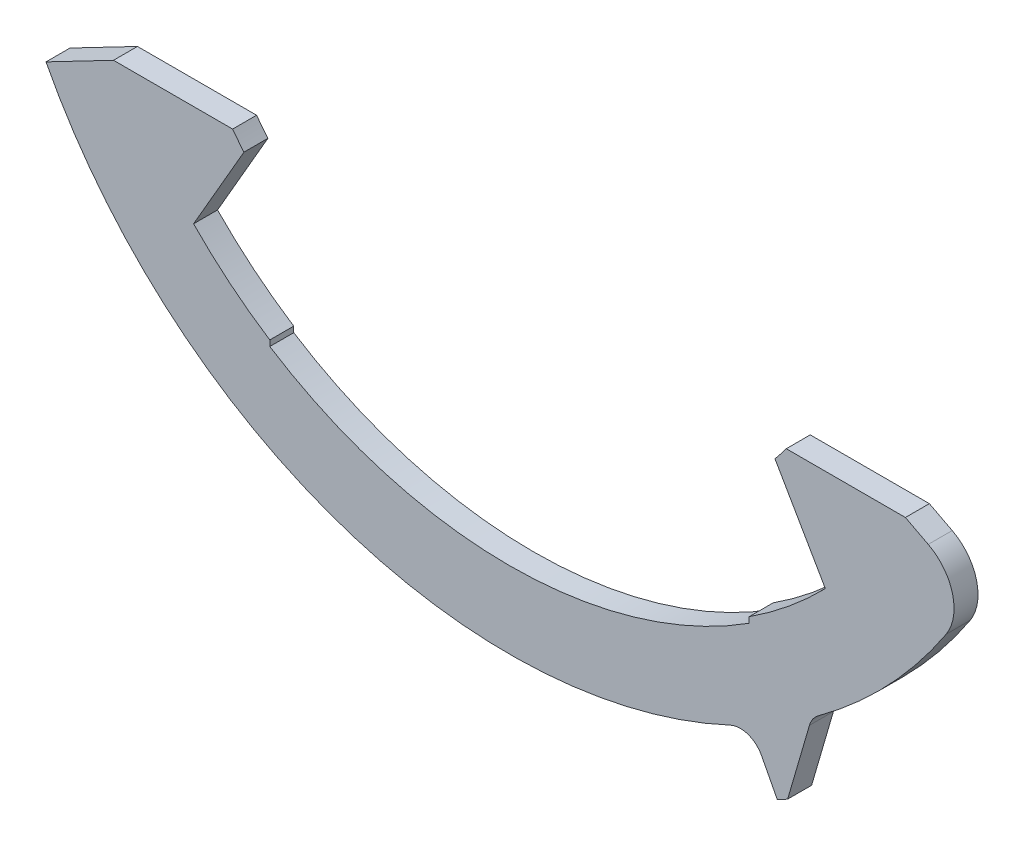
ISO-10303-21;
HEADER;
FILE_DESCRIPTION(('STEP AP214'),'2;1');
FILE_NAME('part.step','',(''),(''),'','','');
FILE_SCHEMA(('AUTOMOTIVE_DESIGN { 1 0 10303 214 1 1 1 1 }'));
ENDSEC;
DATA;
#1=APPLICATION_CONTEXT('core data for automotive mechanical design processes');
#2=APPLICATION_PROTOCOL_DEFINITION('international standard','automotive_design',2000,#1);
#3=PRODUCT_CONTEXT('',#1,'mechanical');
#4=PRODUCT('Part','Part','',(#3));
#5=PRODUCT_RELATED_PRODUCT_CATEGORY('part','',(#4));
#6=PRODUCT_DEFINITION_FORMATION('','',#4);
#7=PRODUCT_DEFINITION_CONTEXT('part definition',#1,'design');
#8=PRODUCT_DEFINITION('design','',#6,#7);
#9=PRODUCT_DEFINITION_SHAPE('','',#8);
#10=(LENGTH_UNIT() NAMED_UNIT(*) SI_UNIT(.MILLI.,.METRE.));
#11=(NAMED_UNIT(*) PLANE_ANGLE_UNIT() SI_UNIT($,.RADIAN.));
#12=(NAMED_UNIT(*) SI_UNIT($,.STERADIAN.) SOLID_ANGLE_UNIT());
#13=UNCERTAINTY_MEASURE_WITH_UNIT(LENGTH_MEASURE(1.E-05),#10,'distance_accuracy_value','');
#14=(GEOMETRIC_REPRESENTATION_CONTEXT(3) GLOBAL_UNCERTAINTY_ASSIGNED_CONTEXT((#13)) GLOBAL_UNIT_ASSIGNED_CONTEXT((#10,
#11,#12)) REPRESENTATION_CONTEXT('',''));
#15=CARTESIAN_POINT('',(0.,0.,0.));
#16=DIRECTION('',(0.,0.,1.));
#17=DIRECTION('',(1.,0.,0.));
#18=AXIS2_PLACEMENT_3D('',#15,#16,#17);
#19=CARTESIAN_POINT('',(4.81536330400592,-10.3330671269683,-0.00100000000000002));
#20=DIRECTION('',(0.,0.,1.));
#21=DIRECTION('',(1.,0.,0.));
#22=AXIS2_PLACEMENT_3D('',#19,#20,#21);
#23=CYLINDRICAL_SURFACE('',#22,0.5);
#24=DIRECTION('',(0.,0.,1.));
#25=VECTOR('',#24,1.);
#26=CARTESIAN_POINT('',(4.60416315909338,-9.87986242841707,-0.00100000000000002));
#27=LINE('',#26,#25);
#28=CARTESIAN_POINT('',(4.60416315909338,-9.87986242841707,0.));
#29=VERTEX_POINT('',#28);
#30=CARTESIAN_POINT('',(4.60416315909338,-9.87986242841707,0.5));
#31=VERTEX_POINT('',#30);
#32=EDGE_CURVE('E200',#29,#31,#27,.T.);
#33=ORIENTED_EDGE('',*,*,#32,.F.);
#34=CARTESIAN_POINT('',(4.81536330400592,-10.3330671269683,0.));
#35=DIRECTION('',(0.,0.,-1.));
#36=DIRECTION('',(-1.,0.,0.));
#37=AXIS2_PLACEMENT_3D('',#34,#35,#36);
#38=CIRCLE('',#37,0.5);
#39=CARTESIAN_POINT('',(5.25886872059503,-10.1021928203508,0.));
#40=VERTEX_POINT('',#39);
#41=EDGE_CURVE('E329',#40,#29,#38,.F.);
#42=ORIENTED_EDGE('',*,*,#41,.F.);
#43=DIRECTION('',(0.,0.,1.));
#44=VECTOR('',#43,1.);
#45=CARTESIAN_POINT('',(5.25886872059503,-10.1021928203508,-0.00100000000000002));
#46=LINE('',#45,#44);
#47=CARTESIAN_POINT('',(5.25886872059503,-10.1021928203508,0.5));
#48=VERTEX_POINT('',#47);
#49=EDGE_CURVE('E340',#40,#48,#46,.T.);
#50=ORIENTED_EDGE('',*,*,#49,.T.);
#51=CARTESIAN_POINT('',(4.81536330400592,-10.3330671269683,0.5));
#52=DIRECTION('',(0.,0.,1.));
#53=DIRECTION('',(0.195090322016125,0.980785280403231,0.));
#54=AXIS2_PLACEMENT_3D('',#51,#52,#53);
#55=CIRCLE('',#54,0.5);
#56=EDGE_CURVE('E337',#48,#31,#55,.T.);
#57=ORIENTED_EDGE('',*,*,#56,.T.);
#58=EDGE_LOOP('',(#33,#42,#50,#57));
#59=FACE_BOUND('',#58,.T.);
#60=ADVANCED_FACE('F53',(#59),#23,.F.);
#61=CARTESIAN_POINT('',(0.,0.,0.5));
#62=DIRECTION('',(0.,0.,-1.));
#63=DIRECTION('',(-1.,0.,0.));
#64=AXIS2_PLACEMENT_3D('',#61,#62,#63);
#65=CYLINDRICAL_SURFACE('',#64,12.1);
#66=CARTESIAN_POINT('',(0.,0.,0.));
#67=DIRECTION('',(0.,0.,1.));
#68=DIRECTION('',(1.,0.,0.));
#69=AXIS2_PLACEMENT_3D('',#66,#67,#68);
#70=CIRCLE('',#69,12.1);
#71=CARTESIAN_POINT('',(5.5871582201439,-10.7328310814565,0.));
#72=VERTEX_POINT('',#71);
#73=CARTESIAN_POINT('',(5.80331443124744,-10.6175110836804,0.));
#74=VERTEX_POINT('',#73);
#75=EDGE_CURVE('E254',#72,#74,#70,.T.);
#76=ORIENTED_EDGE('',*,*,#75,.T.);
#77=DIRECTION('',(0.,0.,1.));
#78=VECTOR('',#77,1.);
#79=CARTESIAN_POINT('',(5.80331443124744,-10.6175110836804,-0.00100000000000002));
#80=LINE('',#79,#78);
#81=CARTESIAN_POINT('',(5.80331443124744,-10.6175110836804,0.5));
#82=VERTEX_POINT('',#81);
#83=EDGE_CURVE('E326',#74,#82,#80,.T.);
#84=ORIENTED_EDGE('',*,*,#83,.T.);
#85=CARTESIAN_POINT('',(0.,0.,0.5));
#86=DIRECTION('',(0.,0.,1.));
#87=DIRECTION('',(1.,0.,0.));
#88=AXIS2_PLACEMENT_3D('',#85,#86,#87);
#89=CIRCLE('',#88,12.1);
#90=CARTESIAN_POINT('',(5.5871582201439,-10.7328310814565,0.5));
#91=VERTEX_POINT('',#90);
#92=EDGE_CURVE('E218',#91,#82,#89,.T.);
#93=ORIENTED_EDGE('',*,*,#92,.F.);
#94=DIRECTION('',(0.,0.,1.));
#95=VECTOR('',#94,1.);
#96=CARTESIAN_POINT('',(5.5871582201439,-10.7328310814565,-0.00100000000000002));
#97=LINE('',#96,#95);
#98=EDGE_CURVE('E339',#72,#91,#97,.T.);
#99=ORIENTED_EDGE('',*,*,#98,.F.);
#100=EDGE_LOOP('',(#76,#84,#93,#99));
#101=FACE_BOUND('',#100,.T.);
#102=ADVANCED_FACE('F385',(#101),#65,.T.);
#103=CARTESIAN_POINT('',(0.,0.,0.5));
#104=DIRECTION('',(0.,0.,-1.));
#105=DIRECTION('',(-1.,0.,0.));
#106=AXIS2_PLACEMENT_3D('',#103,#104,#105);
#107=CYLINDRICAL_SURFACE('',#106,7.2);
#108=CARTESIAN_POINT('',(0.,0.,0.));
#109=DIRECTION('',(0.,0.,-1.));
#110=DIRECTION('',(-1.,0.,0.));
#111=AXIS2_PLACEMENT_3D('',#108,#109,#110);
#112=CIRCLE('',#111,7.2);
#113=CARTESIAN_POINT('',(5.77494588719236,-4.3,0.));
#114=VERTEX_POINT('',#113);
#115=CARTESIAN_POINT('',(5.53923133011576,-4.5996647999027,0.));
#116=VERTEX_POINT('',#115);
#117=EDGE_CURVE('E231',#114,#116,#112,.T.);
#118=ORIENTED_EDGE('',*,*,#117,.T.);
#119=DIRECTION('',(0.,0.,-1.));
#120=VECTOR('',#119,1.);
#121=CARTESIAN_POINT('',(5.53923133011576,-4.5996647999027,0.5));
#122=LINE('',#121,#120);
#123=CARTESIAN_POINT('',(5.53923133011576,-4.5996647999027,0.5));
#124=VERTEX_POINT('',#123);
#125=EDGE_CURVE('E293',#124,#116,#122,.T.);
#126=ORIENTED_EDGE('',*,*,#125,.F.);
#127=CARTESIAN_POINT('',(0.,0.,0.5));
#128=DIRECTION('',(0.,0.,-1.));
#129=DIRECTION('',(-1.,0.,0.));
#130=AXIS2_PLACEMENT_3D('',#127,#128,#129);
#131=CIRCLE('',#130,7.2);
#132=CARTESIAN_POINT('',(5.77494588719236,-4.3,0.5));
#133=VERTEX_POINT('',#132);
#134=EDGE_CURVE('E261',#133,#124,#131,.T.);
#135=ORIENTED_EDGE('',*,*,#134,.F.);
#136=DIRECTION('',(0.,0.,-1.));
#137=VECTOR('',#136,1.);
#138=CARTESIAN_POINT('',(5.77494588719236,-4.3,0.5));
#139=LINE('',#138,#137);
#140=EDGE_CURVE('E230',#133,#114,#139,.T.);
#141=ORIENTED_EDGE('',*,*,#140,.T.);
#142=EDGE_LOOP('',(#118,#126,#135,#141));
#143=FACE_BOUND('',#142,.T.);
#144=ADVANCED_FACE('F396',(#143),#107,.F.);
#145=CARTESIAN_POINT('',(5.53923133011576,-4.5996647999027,0.5));
#146=DIRECTION('',(0.866025403784438,0.500000000000001,0.));
#147=DIRECTION('',(-0.500000000000001,0.866025403784438,0.));
#148=AXIS2_PLACEMENT_3D('',#145,#146,#147);
#149=PLANE('',#148);
#150=DIRECTION('',(0.500000000000001,-0.866025403784438,0.));
#151=VECTOR('',#150,1.);
#152=CARTESIAN_POINT('',(5.53923133011576,-4.5996647999027,0.));
#153=LINE('',#152,#151);
#154=CARTESIAN_POINT('',(6.59,-6.41964952314377,0.));
#155=VERTEX_POINT('',#154);
#156=EDGE_CURVE('E234',#116,#155,#153,.T.);
#157=ORIENTED_EDGE('',*,*,#156,.T.);
#158=DIRECTION('',(0.,0.,-1.));
#159=VECTOR('',#158,1.);
#160=CARTESIAN_POINT('',(6.59,-6.41964952314377,0.5));
#161=LINE('',#160,#159);
#162=CARTESIAN_POINT('',(6.59,-6.41964952314377,0.5));
#163=VERTEX_POINT('',#162);
#164=EDGE_CURVE('E290',#163,#155,#161,.T.);
#165=ORIENTED_EDGE('',*,*,#164,.F.);
#166=DIRECTION('',(0.500000000000001,-0.866025403784438,0.));
#167=VECTOR('',#166,1.);
#168=CARTESIAN_POINT('',(5.53923133011576,-4.5996647999027,0.5));
#169=LINE('',#168,#167);
#170=EDGE_CURVE('E347',#124,#163,#169,.T.);
#171=ORIENTED_EDGE('',*,*,#170,.F.);
#172=ORIENTED_EDGE('',*,*,#125,.T.);
#173=EDGE_LOOP('',(#157,#165,#171,#172));
#174=FACE_BOUND('',#173,.T.);
#175=ADVANCED_FACE('F443',(#174),#149,.F.);
#176=CARTESIAN_POINT('',(0.,0.,0.5));
#177=DIRECTION('',(0.,0.,-1.));
#178=DIRECTION('',(-1.,0.,0.));
#179=AXIS2_PLACEMENT_3D('',#176,#177,#178);
#180=CYLINDRICAL_SURFACE('',#179,9.2);
#181=CARTESIAN_POINT('',(0.,0.,0.));
#182=DIRECTION('',(0.,0.,-1.));
#183=DIRECTION('',(1.,0.,0.));
#184=AXIS2_PLACEMENT_3D('',#181,#182,#183);
#185=CIRCLE('',#184,9.2);
#186=CARTESIAN_POINT('',(5.,-7.72269383052313,0.));
#187=VERTEX_POINT('',#186);
#188=EDGE_CURVE('E237',#155,#187,#185,.T.);
#189=ORIENTED_EDGE('',*,*,#188,.T.);
#190=DIRECTION('',(0.,0.,-1.));
#191=VECTOR('',#190,1.);
#192=CARTESIAN_POINT('',(5.,-7.72269383052313,0.5));
#193=LINE('',#192,#191);
#194=CARTESIAN_POINT('',(5.,-7.72269383052313,0.5));
#195=VERTEX_POINT('',#194);
#196=EDGE_CURVE('E287',#195,#187,#193,.T.);
#197=ORIENTED_EDGE('',*,*,#196,.F.);
#198=CARTESIAN_POINT('',(0.,0.,0.5));
#199=DIRECTION('',(0.,0.,-1.));
#200=DIRECTION('',(1.,0.,0.));
#201=AXIS2_PLACEMENT_3D('',#198,#199,#200);
#202=CIRCLE('',#201,9.2);
#203=EDGE_CURVE('E349',#163,#195,#202,.T.);
#204=ORIENTED_EDGE('',*,*,#203,.F.);
#205=ORIENTED_EDGE('',*,*,#164,.T.);
#206=EDGE_LOOP('',(#189,#197,#204,#205));
#207=FACE_BOUND('',#206,.T.);
#208=ADVANCED_FACE('F439',(#207),#180,.F.);
#209=CARTESIAN_POINT('',(5.,-7.72269383052313,0.5));
#210=DIRECTION('',(1.,0.,0.));
#211=DIRECTION('',(0.,0.,-1.));
#212=AXIS2_PLACEMENT_3D('',#209,#210,#211);
#213=PLANE('',#212);
#214=DIRECTION('',(0.,-1.,0.));
#215=VECTOR('',#214,1.);
#216=CARTESIAN_POINT('',(5.,-7.72269383052313,0.));
#217=LINE('',#216,#215);
#218=CARTESIAN_POINT('',(4.99999999999999,-7.84155596804614,0.));
#219=VERTEX_POINT('',#218);
#220=EDGE_CURVE('E239',#187,#219,#217,.T.);
#221=ORIENTED_EDGE('',*,*,#220,.T.);
#222=DIRECTION('',(0.,0.,-1.));
#223=VECTOR('',#222,1.);
#224=CARTESIAN_POINT('',(4.99999999999999,-7.84155596804614,0.5));
#225=LINE('',#224,#223);
#226=CARTESIAN_POINT('',(4.99999999999999,-7.84155596804614,0.5));
#227=VERTEX_POINT('',#226);
#228=EDGE_CURVE('E284',#227,#219,#225,.T.);
#229=ORIENTED_EDGE('',*,*,#228,.F.);
#230=DIRECTION('',(0.,-1.,0.));
#231=VECTOR('',#230,1.);
#232=CARTESIAN_POINT('',(5.,-7.72269383052313,0.5));
#233=LINE('',#232,#231);
#234=EDGE_CURVE('E351',#195,#227,#233,.T.);
#235=ORIENTED_EDGE('',*,*,#234,.F.);
#236=ORIENTED_EDGE('',*,*,#196,.T.);
#237=EDGE_LOOP('',(#221,#229,#235,#236));
#238=FACE_BOUND('',#237,.T.);
#239=ADVANCED_FACE('F435',(#238),#213,.F.);
#240=CARTESIAN_POINT('',(0.,0.,0.5));
#241=DIRECTION('',(0.,0.,-1.));
#242=DIRECTION('',(-1.,0.,0.));
#243=AXIS2_PLACEMENT_3D('',#240,#241,#242);
#244=CYLINDRICAL_SURFACE('',#243,9.3);
#245=CARTESIAN_POINT('',(0.,0.,0.));
#246=DIRECTION('',(0.,0.,-1.));
#247=DIRECTION('',(1.,0.,0.));
#248=AXIS2_PLACEMENT_3D('',#245,#246,#247);
#249=CIRCLE('',#248,9.3);
#250=CARTESIAN_POINT('',(-5.,-7.84155596804614,0.));
#251=VERTEX_POINT('',#250);
#252=EDGE_CURVE('E241',#219,#251,#249,.T.);
#253=ORIENTED_EDGE('',*,*,#252,.T.);
#254=DIRECTION('',(0.,0.,-1.));
#255=VECTOR('',#254,1.);
#256=CARTESIAN_POINT('',(-5.,-7.84155596804614,0.5));
#257=LINE('',#256,#255);
#258=CARTESIAN_POINT('',(-5.,-7.84155596804614,0.5));
#259=VERTEX_POINT('',#258);
#260=EDGE_CURVE('E281',#259,#251,#257,.T.);
#261=ORIENTED_EDGE('',*,*,#260,.F.);
#262=CARTESIAN_POINT('',(0.,0.,0.5));
#263=DIRECTION('',(0.,0.,-1.));
#264=DIRECTION('',(1.,0.,0.));
#265=AXIS2_PLACEMENT_3D('',#262,#263,#264);
#266=CIRCLE('',#265,9.3);
#267=EDGE_CURVE('E353',#227,#259,#266,.T.);
#268=ORIENTED_EDGE('',*,*,#267,.F.);
#269=ORIENTED_EDGE('',*,*,#228,.T.);
#270=EDGE_LOOP('',(#253,#261,#268,#269));
#271=FACE_BOUND('',#270,.T.);
#272=ADVANCED_FACE('F431',(#271),#244,.F.);
#273=CARTESIAN_POINT('',(-5.,-7.72269383052313,0.5));
#274=DIRECTION('',(-1.,0.,0.));
#275=DIRECTION('',(0.,0.,1.));
#276=AXIS2_PLACEMENT_3D('',#273,#274,#275);
#277=PLANE('',#276);
#278=DIRECTION('',(0.,1.,0.));
#279=VECTOR('',#278,1.);
#280=CARTESIAN_POINT('',(-5.,-7.72269383052313,0.));
#281=LINE('',#280,#279);
#282=CARTESIAN_POINT('',(-5.00000000000001,-7.72269383052313,0.));
#283=VERTEX_POINT('',#282);
#284=EDGE_CURVE('E243',#251,#283,#281,.T.);
#285=ORIENTED_EDGE('',*,*,#284,.T.);
#286=DIRECTION('',(0.,0.,-1.));
#287=VECTOR('',#286,1.);
#288=CARTESIAN_POINT('',(-5.00000000000001,-7.72269383052313,0.5));
#289=LINE('',#288,#287);
#290=CARTESIAN_POINT('',(-5.00000000000001,-7.72269383052313,0.5));
#291=VERTEX_POINT('',#290);
#292=EDGE_CURVE('E278',#291,#283,#289,.T.);
#293=ORIENTED_EDGE('',*,*,#292,.F.);
#294=DIRECTION('',(0.,1.,0.));
#295=VECTOR('',#294,1.);
#296=CARTESIAN_POINT('',(-5.,-7.72269383052313,0.5));
#297=LINE('',#296,#295);
#298=EDGE_CURVE('E355',#259,#291,#297,.T.);
#299=ORIENTED_EDGE('',*,*,#298,.F.);
#300=ORIENTED_EDGE('',*,*,#260,.T.);
#301=EDGE_LOOP('',(#285,#293,#299,#300));
#302=FACE_BOUND('',#301,.T.);
#303=ADVANCED_FACE('F427',(#302),#277,.F.);
#304=CARTESIAN_POINT('',(0.,0.,0.5));
#305=DIRECTION('',(0.,0.,-1.));
#306=DIRECTION('',(-1.,0.,0.));
#307=AXIS2_PLACEMENT_3D('',#304,#305,#306);
#308=CYLINDRICAL_SURFACE('',#307,9.2);
#309=CARTESIAN_POINT('',(0.,0.,0.));
#310=DIRECTION('',(0.,0.,-1.));
#311=DIRECTION('',(1.,0.,0.));
#312=AXIS2_PLACEMENT_3D('',#309,#310,#311);
#313=CIRCLE('',#312,9.2);
#314=CARTESIAN_POINT('',(-6.59,-6.41964952314377,0.));
#315=VERTEX_POINT('',#314);
#316=EDGE_CURVE('E245',#283,#315,#313,.T.);
#317=ORIENTED_EDGE('',*,*,#316,.T.);
#318=DIRECTION('',(0.,0.,-1.));
#319=VECTOR('',#318,1.);
#320=CARTESIAN_POINT('',(-6.59,-6.41964952314377,0.5));
#321=LINE('',#320,#319);
#322=CARTESIAN_POINT('',(-6.59,-6.41964952314377,0.5));
#323=VERTEX_POINT('',#322);
#324=EDGE_CURVE('E275',#323,#315,#321,.T.);
#325=ORIENTED_EDGE('',*,*,#324,.F.);
#326=CARTESIAN_POINT('',(0.,0.,0.5));
#327=DIRECTION('',(0.,0.,-1.));
#328=DIRECTION('',(1.,0.,0.));
#329=AXIS2_PLACEMENT_3D('',#326,#327,#328);
#330=CIRCLE('',#329,9.2);
#331=EDGE_CURVE('E357',#291,#323,#330,.T.);
#332=ORIENTED_EDGE('',*,*,#331,.F.);
#333=ORIENTED_EDGE('',*,*,#292,.T.);
#334=EDGE_LOOP('',(#317,#325,#332,#333));
#335=FACE_BOUND('',#334,.T.);
#336=ADVANCED_FACE('F423',(#335),#308,.F.);
#337=CARTESIAN_POINT('',(-5.53923133011576,-4.5996647999027,0.5));
#338=DIRECTION('',(-0.866025403784438,0.500000000000001,0.));
#339=DIRECTION('',(-0.500000000000001,-0.866025403784438,0.));
#340=AXIS2_PLACEMENT_3D('',#337,#338,#339);
#341=PLANE('',#340);
#342=DIRECTION('',(0.500000000000001,0.866025403784438,0.));
#343=VECTOR('',#342,1.);
#344=CARTESIAN_POINT('',(-5.53923133011576,-4.5996647999027,0.));
#345=LINE('',#344,#343);
#346=CARTESIAN_POINT('',(-5.53923133011576,-4.5996647999027,0.));
#347=VERTEX_POINT('',#346);
#348=EDGE_CURVE('E247',#315,#347,#345,.T.);
#349=ORIENTED_EDGE('',*,*,#348,.T.);
#350=DIRECTION('',(0.,0.,-1.));
#351=VECTOR('',#350,1.);
#352=CARTESIAN_POINT('',(-5.53923133011576,-4.5996647999027,0.5));
#353=LINE('',#352,#351);
#354=CARTESIAN_POINT('',(-5.53923133011576,-4.5996647999027,0.5));
#355=VERTEX_POINT('',#354);
#356=EDGE_CURVE('E272',#355,#347,#353,.T.);
#357=ORIENTED_EDGE('',*,*,#356,.F.);
#358=DIRECTION('',(0.500000000000001,0.866025403784438,0.));
#359=VECTOR('',#358,1.);
#360=CARTESIAN_POINT('',(-5.53923133011576,-4.5996647999027,0.5));
#361=LINE('',#360,#359);
#362=EDGE_CURVE('E359',#323,#355,#361,.T.);
#363=ORIENTED_EDGE('',*,*,#362,.F.);
#364=ORIENTED_EDGE('',*,*,#324,.T.);
#365=EDGE_LOOP('',(#349,#357,#363,#364));
#366=FACE_BOUND('',#365,.T.);
#367=ADVANCED_FACE('F420',(#366),#341,.F.);
#368=CARTESIAN_POINT('',(0.,0.,0.5));
#369=DIRECTION('',(0.,0.,-1.));
#370=DIRECTION('',(-1.,0.,0.));
#371=AXIS2_PLACEMENT_3D('',#368,#369,#370);
#372=CYLINDRICAL_SURFACE('',#371,7.2);
#373=CARTESIAN_POINT('',(0.,0.,0.));
#374=DIRECTION('',(0.,0.,-1.));
#375=DIRECTION('',(1.,0.,0.));
#376=AXIS2_PLACEMENT_3D('',#373,#374,#375);
#377=CIRCLE('',#376,7.2);
#378=CARTESIAN_POINT('',(-5.77494588719236,-4.3,0.));
#379=VERTEX_POINT('',#378);
#380=EDGE_CURVE('E249',#347,#379,#377,.T.);
#381=ORIENTED_EDGE('',*,*,#380,.T.);
#382=DIRECTION('',(0.,0.,-1.));
#383=VECTOR('',#382,1.);
#384=CARTESIAN_POINT('',(-5.77494588719236,-4.3,0.5));
#385=LINE('',#384,#383);
#386=CARTESIAN_POINT('',(-5.77494588719236,-4.3,0.5));
#387=VERTEX_POINT('',#386);
#388=EDGE_CURVE('E269',#387,#379,#385,.T.);
#389=ORIENTED_EDGE('',*,*,#388,.F.);
#390=CARTESIAN_POINT('',(0.,0.,0.5));
#391=DIRECTION('',(0.,0.,-1.));
#392=DIRECTION('',(1.,0.,0.));
#393=AXIS2_PLACEMENT_3D('',#390,#391,#392);
#394=CIRCLE('',#393,7.2);
#395=EDGE_CURVE('E223',#355,#387,#394,.T.);
#396=ORIENTED_EDGE('',*,*,#395,.F.);
#397=ORIENTED_EDGE('',*,*,#356,.T.);
#398=EDGE_LOOP('',(#381,#389,#396,#397));
#399=FACE_BOUND('',#398,.T.);
#400=ADVANCED_FACE('F365',(#399),#372,.F.);
#401=CARTESIAN_POINT('',(-8.26022314597606,-4.3,0.5));
#402=DIRECTION('',(0.,-1.,0.));
#403=DIRECTION('',(1.,0.,0.));
#404=AXIS2_PLACEMENT_3D('',#401,#402,#403);
#405=PLANE('',#404);
#406=DIRECTION('',(-1.,0.,0.));
#407=VECTOR('',#406,1.);
#408=CARTESIAN_POINT('',(-8.26022314597606,-4.3,0.));
#409=LINE('',#408,#407);
#410=CARTESIAN_POINT('',(-8.26022314597606,-4.3,0.));
#411=VERTEX_POINT('',#410);
#412=EDGE_CURVE('E251',#379,#411,#409,.T.);
#413=ORIENTED_EDGE('',*,*,#412,.T.);
#414=DIRECTION('',(0.,0.,-1.));
#415=VECTOR('',#414,1.);
#416=CARTESIAN_POINT('',(-8.26022314597606,-4.3,0.5));
#417=LINE('',#416,#415);
#418=CARTESIAN_POINT('',(-8.26022314597606,-4.3,0.5));
#419=VERTEX_POINT('',#418);
#420=EDGE_CURVE('E267',#419,#411,#417,.T.);
#421=ORIENTED_EDGE('',*,*,#420,.F.);
#422=DIRECTION('',(-1.,0.,0.));
#423=VECTOR('',#422,1.);
#424=CARTESIAN_POINT('',(-8.26022314597606,-4.3,0.5));
#425=LINE('',#424,#423);
#426=EDGE_CURVE('E216',#387,#419,#425,.T.);
#427=ORIENTED_EDGE('',*,*,#426,.F.);
#428=ORIENTED_EDGE('',*,*,#388,.T.);
#429=EDGE_LOOP('',(#413,#421,#427,#428));
#430=FACE_BOUND('',#429,.T.);
#431=ADVANCED_FACE('F369',(#430),#405,.F.);
#432=CARTESIAN_POINT('',(-8.26022314597606,-4.3,0.5));
#433=DIRECTION('',(0.461748613235031,-0.887010833178223,0.));
#434=DIRECTION('',(0.887010833178223,0.461748613235031,0.));
#435=AXIS2_PLACEMENT_3D('',#432,#433,#434);
#436=PLANE('',#435);
#437=DIRECTION('',(-0.887010833178223,-0.461748613235031,0.));
#438=VECTOR('',#437,1.);
#439=CARTESIAN_POINT('',(-8.26022314597606,-4.3,0.));
#440=LINE('',#439,#438);
#441=CARTESIAN_POINT('',(-9.66841808164263,-5.03305988426184,0.));
#442=VERTEX_POINT('',#441);
#443=EDGE_CURVE('E212',#411,#442,#440,.T.);
#444=ORIENTED_EDGE('',*,*,#443,.T.);
#445=DIRECTION('',(0.,0.,1.));
#446=VECTOR('',#445,1.);
#447=CARTESIAN_POINT('',(-9.66841808164263,-5.03305988426184,-0.00100000000000002));
#448=LINE('',#447,#446);
#449=CARTESIAN_POINT('',(-9.66841808164263,-5.03305988426184,0.5));
#450=VERTEX_POINT('',#449);
#451=EDGE_CURVE('E197',#442,#450,#448,.T.);
#452=ORIENTED_EDGE('',*,*,#451,.T.);
#453=DIRECTION('',(-0.887010833178223,-0.461748613235031,0.));
#454=VECTOR('',#453,1.);
#455=CARTESIAN_POINT('',(-8.26022314597606,-4.3,0.5));
#456=LINE('',#455,#454);
#457=EDGE_CURVE('E210',#419,#450,#456,.T.);
#458=ORIENTED_EDGE('',*,*,#457,.F.);
#459=ORIENTED_EDGE('',*,*,#420,.T.);
#460=EDGE_LOOP('',(#444,#452,#458,#459));
#461=FACE_BOUND('',#460,.T.);
#462=ADVANCED_FACE('F208',(#461),#436,.F.);
#463=CARTESIAN_POINT('',(8.26022314597606,-4.3,0.5));
#464=DIRECTION('',(-0.461748613235032,-0.887010833178223,0.));
#465=DIRECTION('',(0.887010833178223,-0.461748613235032,0.));
#466=AXIS2_PLACEMENT_3D('',#463,#464,#465);
#467=PLANE('',#466);
#468=DIRECTION('',(-0.887010833178223,0.461748613235032,0.));
#469=VECTOR('',#468,1.);
#470=CARTESIAN_POINT('',(8.26022314597606,-4.3,0.5));
#471=LINE('',#470,#469);
#472=CARTESIAN_POINT('',(8.73649386454358,-4.54793084322885,0.5));
#473=VERTEX_POINT('',#472);
#474=CARTESIAN_POINT('',(8.26022314597606,-4.3,0.5));
#475=VERTEX_POINT('',#474);
#476=EDGE_CURVE('E221',#473,#475,#471,.T.);
#477=ORIENTED_EDGE('',*,*,#476,.F.);
#478=DIRECTION('',(0.,0.,1.));
#479=VECTOR('',#478,1.);
#480=CARTESIAN_POINT('',(8.73649386454358,-4.54793084322885,0.5));
#481=LINE('',#480,#479);
#482=CARTESIAN_POINT('',(8.73649386454358,-4.54793084322885,0.));
#483=VERTEX_POINT('',#482);
#484=EDGE_CURVE('E61',#473,#483,#481,.F.);
#485=ORIENTED_EDGE('',*,*,#484,.T.);
#486=DIRECTION('',(-0.887010833178223,0.461748613235032,0.));
#487=VECTOR('',#486,1.);
#488=CARTESIAN_POINT('',(8.26022314597606,-4.3,0.));
#489=LINE('',#488,#487);
#490=CARTESIAN_POINT('',(8.26022314597606,-4.3,0.));
#491=VERTEX_POINT('',#490);
#492=EDGE_CURVE('E257',#483,#491,#489,.T.);
#493=ORIENTED_EDGE('',*,*,#492,.T.);
#494=DIRECTION('',(0.,0.,-1.));
#495=VECTOR('',#494,1.);
#496=CARTESIAN_POINT('',(8.26022314597606,-4.3,0.5));
#497=LINE('',#496,#495);
#498=EDGE_CURVE('E264',#475,#491,#497,.T.);
#499=ORIENTED_EDGE('',*,*,#498,.F.);
#500=EDGE_LOOP('',(#477,#485,#493,#499));
#501=FACE_BOUND('',#500,.T.);
#502=ADVANCED_FACE('F410',(#501),#467,.F.);
#503=CARTESIAN_POINT('',(5.77494588719236,-4.3,0.5));
#504=DIRECTION('',(0.,-1.,0.));
#505=DIRECTION('',(1.,0.,0.));
#506=AXIS2_PLACEMENT_3D('',#503,#504,#505);
#507=PLANE('',#506);
#508=DIRECTION('',(-1.,0.,0.));
#509=VECTOR('',#508,1.);
#510=CARTESIAN_POINT('',(5.77494588719236,-4.3,0.));
#511=LINE('',#510,#509);
#512=EDGE_CURVE('E259',#491,#114,#511,.T.);
#513=ORIENTED_EDGE('',*,*,#512,.T.);
#514=ORIENTED_EDGE('',*,*,#140,.F.);
#515=DIRECTION('',(-1.,0.,0.));
#516=VECTOR('',#515,1.);
#517=CARTESIAN_POINT('',(5.77494588719236,-4.3,0.5));
#518=LINE('',#517,#516);
#519=EDGE_CURVE('E228',#475,#133,#518,.T.);
#520=ORIENTED_EDGE('',*,*,#519,.F.);
#521=ORIENTED_EDGE('',*,*,#498,.T.);
#522=EDGE_LOOP('',(#513,#514,#520,#521));
#523=FACE_BOUND('',#522,.T.);
#524=ADVANCED_FACE('F405',(#523),#507,.F.);
#525=CARTESIAN_POINT('',(0.,0.,0.5));
#526=DIRECTION('',(0.,0.,-1.));
#527=DIRECTION('',(-1.,0.,0.));
#528=AXIS2_PLACEMENT_3D('',#525,#526,#527);
#529=PLANE('',#528);
#530=ORIENTED_EDGE('',*,*,#457,.T.);
#531=CARTESIAN_POINT('',(0.,0.,0.5));
#532=DIRECTION('',(0.,0.,-1.));
#533=DIRECTION('',(1.,0.,0.));
#534=AXIS2_PLACEMENT_3D('',#531,#532,#533);
#535=CIRCLE('',#534,10.9);
#536=EDGE_CURVE('E194',#31,#450,#535,.T.);
#537=ORIENTED_EDGE('',*,*,#536,.F.);
#538=ORIENTED_EDGE('',*,*,#56,.F.);
#539=DIRECTION('',(-0.461748613235033,0.887010833178222,0.));
#540=VECTOR('',#539,1.);
#541=CARTESIAN_POINT('',(5.25886872059503,-10.1021928203508,0.5));
#542=LINE('',#541,#540);
#543=EDGE_CURVE('E334',#91,#48,#542,.T.);
#544=ORIENTED_EDGE('',*,*,#543,.F.);
#545=ORIENTED_EDGE('',*,*,#92,.T.);
#546=DIRECTION('',(-0.279829014030988,-0.96004985438593,0.));
#547=VECTOR('',#546,1.);
#548=CARTESIAN_POINT('',(5.80331443124744,-10.6175110836804,0.5));
#549=LINE('',#548,#547);
#550=CARTESIAN_POINT('',(6.25869391438443,-9.05517485493036,0.5));
#551=VERTEX_POINT('',#550);
#552=EDGE_CURVE('E323',#551,#82,#549,.T.);
#553=ORIENTED_EDGE('',*,*,#552,.F.);
#554=CARTESIAN_POINT('',(6.73871884157739,-9.19508936194586,0.5));
#555=DIRECTION('',(0.,0.,1.));
#556=DIRECTION('',(0.,1.,0.));
#557=AXIS2_PLACEMENT_3D('',#554,#555,#556);
#558=CIRCLE('',#557,0.5);
#559=CARTESIAN_POINT('',(6.44316099764856,-8.79179596887805,0.5));
#560=VERTEX_POINT('',#559);
#561=EDGE_CURVE('E311',#560,#551,#558,.T.);
#562=ORIENTED_EDGE('',*,*,#561,.F.);
#563=CARTESIAN_POINT('',(0.,0.,0.5));
#564=DIRECTION('',(0.,0.,-1.));
#565=DIRECTION('',(-1.,0.,0.));
#566=AXIS2_PLACEMENT_3D('',#563,#564,#565);
#567=CIRCLE('',#566,10.9);
#568=CARTESIAN_POINT('',(9.11057810497609,-5.98392568412496,0.5));
#569=VERTEX_POINT('',#568);
#570=EDGE_CURVE('E304',#569,#560,#567,.T.);
#571=ORIENTED_EDGE('',*,*,#570,.F.);
#572=CARTESIAN_POINT('',(8.27474525130855,-5.43494167640707,0.5));
#573=DIRECTION('',(0.,0.,-1.));
#574=DIRECTION('',(-1.,0.,0.));
#575=AXIS2_PLACEMENT_3D('',#572,#573,#574);
#576=CIRCLE('',#575,1.);
#577=EDGE_CURVE('E75',#569,#473,#576,.F.);
#578=ORIENTED_EDGE('',*,*,#577,.T.);
#579=ORIENTED_EDGE('',*,*,#476,.T.);
#580=ORIENTED_EDGE('',*,*,#519,.T.);
#581=ORIENTED_EDGE('',*,*,#134,.T.);
#582=ORIENTED_EDGE('',*,*,#170,.T.);
#583=ORIENTED_EDGE('',*,*,#203,.T.);
#584=ORIENTED_EDGE('',*,*,#234,.T.);
#585=ORIENTED_EDGE('',*,*,#267,.T.);
#586=ORIENTED_EDGE('',*,*,#298,.T.);
#587=ORIENTED_EDGE('',*,*,#331,.T.);
#588=ORIENTED_EDGE('',*,*,#362,.T.);
#589=ORIENTED_EDGE('',*,*,#395,.T.);
#590=ORIENTED_EDGE('',*,*,#426,.T.);
#591=EDGE_LOOP('',(#530,#537,#538,#544,#545,#553,#562,#571,#578,#579,#580,#581,#582,#583,#584,
#585,#586,#587,#588,#589,#590));
#592=FACE_BOUND('',#591,.T.);
#593=ADVANCED_FACE('F214',(#592),#529,.F.);
#594=CARTESIAN_POINT('',(0.,0.,0.));
#595=DIRECTION('',(0.,0.,-1.));
#596=DIRECTION('',(-1.,0.,0.));
#597=AXIS2_PLACEMENT_3D('',#594,#595,#596);
#598=PLANE('',#597);
#599=CARTESIAN_POINT('',(0.,0.,0.));
#600=DIRECTION('',(0.,0.,-1.));
#601=DIRECTION('',(-1.,0.,0.));
#602=AXIS2_PLACEMENT_3D('',#599,#600,#601);
#603=CIRCLE('',#602,10.9);
#604=EDGE_CURVE('E204',#29,#442,#603,.T.);
#605=ORIENTED_EDGE('',*,*,#604,.T.);
#606=ORIENTED_EDGE('',*,*,#443,.F.);
#607=ORIENTED_EDGE('',*,*,#412,.F.);
#608=ORIENTED_EDGE('',*,*,#380,.F.);
#609=ORIENTED_EDGE('',*,*,#348,.F.);
#610=ORIENTED_EDGE('',*,*,#316,.F.);
#611=ORIENTED_EDGE('',*,*,#284,.F.);
#612=ORIENTED_EDGE('',*,*,#252,.F.);
#613=ORIENTED_EDGE('',*,*,#220,.F.);
#614=ORIENTED_EDGE('',*,*,#188,.F.);
#615=ORIENTED_EDGE('',*,*,#156,.F.);
#616=ORIENTED_EDGE('',*,*,#117,.F.);
#617=ORIENTED_EDGE('',*,*,#512,.F.);
#618=ORIENTED_EDGE('',*,*,#492,.F.);
#619=CARTESIAN_POINT('',(8.27474525130855,-5.43494167640707,0.));
#620=DIRECTION('',(0.,0.,-1.));
#621=DIRECTION('',(-1.,0.,0.));
#622=AXIS2_PLACEMENT_3D('',#619,#620,#621);
#623=CIRCLE('',#622,1.);
#624=CARTESIAN_POINT('',(9.11057810497609,-5.98392568412496,0.));
#625=VERTEX_POINT('',#624);
#626=EDGE_CURVE('E12',#483,#625,#623,.T.);
#627=ORIENTED_EDGE('',*,*,#626,.T.);
#628=CARTESIAN_POINT('',(0.,0.,0.));
#629=DIRECTION('',(0.,0.,-1.));
#630=DIRECTION('',(-1.,0.,0.));
#631=AXIS2_PLACEMENT_3D('',#628,#629,#630);
#632=CIRCLE('',#631,10.9);
#633=CARTESIAN_POINT('',(6.44316099764856,-8.79179596887806,0.));
#634=VERTEX_POINT('',#633);
#635=EDGE_CURVE('E306',#625,#634,#632,.T.);
#636=ORIENTED_EDGE('',*,*,#635,.T.);
#637=CARTESIAN_POINT('',(6.73871884157739,-9.19508936194586,0.));
#638=DIRECTION('',(0.,0.,-1.));
#639=DIRECTION('',(-1.,0.,0.));
#640=AXIS2_PLACEMENT_3D('',#637,#638,#639);
#641=CIRCLE('',#640,0.5);
#642=CARTESIAN_POINT('',(6.25869391438443,-9.05517485493036,0.));
#643=VERTEX_POINT('',#642);
#644=EDGE_CURVE('E312',#634,#643,#641,.F.);
#645=ORIENTED_EDGE('',*,*,#644,.T.);
#646=DIRECTION('',(-0.279829014030988,-0.96004985438593,0.));
#647=VECTOR('',#646,1.);
#648=CARTESIAN_POINT('',(5.80331443124744,-10.6175110836804,0.));
#649=LINE('',#648,#647);
#650=EDGE_CURVE('E314',#643,#74,#649,.T.);
#651=ORIENTED_EDGE('',*,*,#650,.T.);
#652=ORIENTED_EDGE('',*,*,#75,.F.);
#653=DIRECTION('',(-0.461748613235033,0.887010833178222,0.));
#654=VECTOR('',#653,1.);
#655=CARTESIAN_POINT('',(5.25886872059503,-10.1021928203508,0.));
#656=LINE('',#655,#654);
#657=EDGE_CURVE('E235',#72,#40,#656,.T.);
#658=ORIENTED_EDGE('',*,*,#657,.T.);
#659=ORIENTED_EDGE('',*,*,#41,.T.);
#660=EDGE_LOOP('',(#605,#606,#607,#608,#609,#610,#611,#612,#613,#614,#615,#616,#617,#618,#627,
#636,#645,#651,#652,#658,#659));
#661=FACE_BOUND('',#660,.T.);
#662=ADVANCED_FACE('F371',(#661),#598,.T.);
#663=CARTESIAN_POINT('',(5.25886872059503,-10.1021928203508,-0.00100000000000002));
#664=DIRECTION('',(0.887010833178222,0.461748613235033,0.));
#665=DIRECTION('',(-0.461748613235033,0.887010833178222,0.));
#666=AXIS2_PLACEMENT_3D('',#663,#664,#665);
#667=PLANE('',#666);
#668=ORIENTED_EDGE('',*,*,#98,.T.);
#669=ORIENTED_EDGE('',*,*,#543,.T.);
#670=ORIENTED_EDGE('',*,*,#49,.F.);
#671=ORIENTED_EDGE('',*,*,#657,.F.);
#672=EDGE_LOOP('',(#668,#669,#670,#671));
#673=FACE_BOUND('',#672,.T.);
#674=ADVANCED_FACE('F389',(#673),#667,.F.);
#675=CARTESIAN_POINT('',(5.80331443124744,-10.6175110836804,-0.00100000000000002));
#676=DIRECTION('',(-0.96004985438593,0.279829014030988,0.));
#677=DIRECTION('',(-0.279829014030988,-0.96004985438593,0.));
#678=AXIS2_PLACEMENT_3D('',#675,#676,#677);
#679=PLANE('',#678);
#680=DIRECTION('',(0.,0.,1.));
#681=VECTOR('',#680,1.);
#682=CARTESIAN_POINT('',(6.25869391438443,-9.05517485493036,-0.00100000000000002));
#683=LINE('',#682,#681);
#684=EDGE_CURVE('E325',#643,#551,#683,.T.);
#685=ORIENTED_EDGE('',*,*,#684,.T.);
#686=ORIENTED_EDGE('',*,*,#552,.T.);
#687=ORIENTED_EDGE('',*,*,#83,.F.);
#688=ORIENTED_EDGE('',*,*,#650,.F.);
#689=EDGE_LOOP('',(#685,#686,#687,#688));
#690=FACE_BOUND('',#689,.T.);
#691=ADVANCED_FACE('F382',(#690),#679,.F.);
#692=CARTESIAN_POINT('',(6.73871884157739,-9.19508936194586,-0.00100000000000002));
#693=DIRECTION('',(0.,0.,1.));
#694=DIRECTION('',(1.,0.,0.));
#695=AXIS2_PLACEMENT_3D('',#692,#693,#694);
#696=CYLINDRICAL_SURFACE('',#695,0.5);
#697=ORIENTED_EDGE('',*,*,#644,.F.);
#698=DIRECTION('',(0.,0.,1.));
#699=VECTOR('',#698,1.);
#700=CARTESIAN_POINT('',(6.44316099764856,-8.79179596887805,-0.00100000000000002));
#701=LINE('',#700,#699);
#702=EDGE_CURVE('E316',#634,#560,#701,.T.);
#703=ORIENTED_EDGE('',*,*,#702,.T.);
#704=ORIENTED_EDGE('',*,*,#561,.T.);
#705=ORIENTED_EDGE('',*,*,#684,.F.);
#706=EDGE_LOOP('',(#697,#703,#704,#705));
#707=FACE_BOUND('',#706,.T.);
#708=ADVANCED_FACE('F377',(#707),#696,.F.);
#709=CARTESIAN_POINT('',(0.,0.,-0.00100000000000002));
#710=DIRECTION('',(0.,0.,1.));
#711=DIRECTION('',(1.,0.,0.));
#712=AXIS2_PLACEMENT_3D('',#709,#710,#711);
#713=CYLINDRICAL_SURFACE('',#712,10.9);
#714=ORIENTED_EDGE('',*,*,#635,.F.);
#715=DIRECTION('',(0.,0.,1.));
#716=VECTOR('',#715,1.);
#717=CARTESIAN_POINT('',(9.11057810497609,-5.98392568412496,-0.00100000000000002));
#718=LINE('',#717,#716);
#719=EDGE_CURVE('E296',#625,#569,#718,.T.);
#720=ORIENTED_EDGE('',*,*,#719,.T.);
#721=ORIENTED_EDGE('',*,*,#570,.T.);
#722=ORIENTED_EDGE('',*,*,#702,.F.);
#723=EDGE_LOOP('',(#714,#720,#721,#722));
#724=FACE_BOUND('',#723,.T.);
#725=ADVANCED_FACE('F302',(#724),#713,.T.);
#726=CARTESIAN_POINT('',(8.27474525130855,-5.43494167640707,-0.00100000000000002));
#727=DIRECTION('',(0.,0.,1.));
#728=DIRECTION('',(1.,0.,0.));
#729=AXIS2_PLACEMENT_3D('',#726,#727,#728);
#730=CYLINDRICAL_SURFACE('',#729,1.);
#731=ORIENTED_EDGE('',*,*,#626,.F.);
#732=ORIENTED_EDGE('',*,*,#484,.F.);
#733=ORIENTED_EDGE('',*,*,#577,.F.);
#734=ORIENTED_EDGE('',*,*,#719,.F.);
#735=EDGE_LOOP('',(#731,#732,#733,#734));
#736=FACE_BOUND('',#735,.T.);
#737=ADVANCED_FACE('F55',(#736),#730,.T.);
#738=CARTESIAN_POINT('',(0.,0.,-0.00100000000000002));
#739=DIRECTION('',(0.,0.,1.));
#740=DIRECTION('',(1.,0.,0.));
#741=AXIS2_PLACEMENT_3D('',#738,#739,#740);
#742=CYLINDRICAL_SURFACE('',#741,10.9);
#743=ORIENTED_EDGE('',*,*,#604,.F.);
#744=ORIENTED_EDGE('',*,*,#32,.T.);
#745=ORIENTED_EDGE('',*,*,#536,.T.);
#746=ORIENTED_EDGE('',*,*,#451,.F.);
#747=EDGE_LOOP('',(#743,#744,#745,#746));
#748=FACE_BOUND('',#747,.T.);
#749=ADVANCED_FACE('F196',(#748),#742,.T.);
#750=CLOSED_SHELL('',(#60,#102,#144,#175,#208,#239,#272,#303,#336,#367,#400,#431,#462,#502,#524,
#593,#662,#674,#691,#708,#725,#737,#749));
#751=MANIFOLD_SOLID_BREP('B2',#750);
#752=ADVANCED_BREP_SHAPE_REPRESENTATION('',(#18,#751),#14);
#753=SHAPE_DEFINITION_REPRESENTATION(#9,#752);
ENDSEC;
END-ISO-10303-21;
